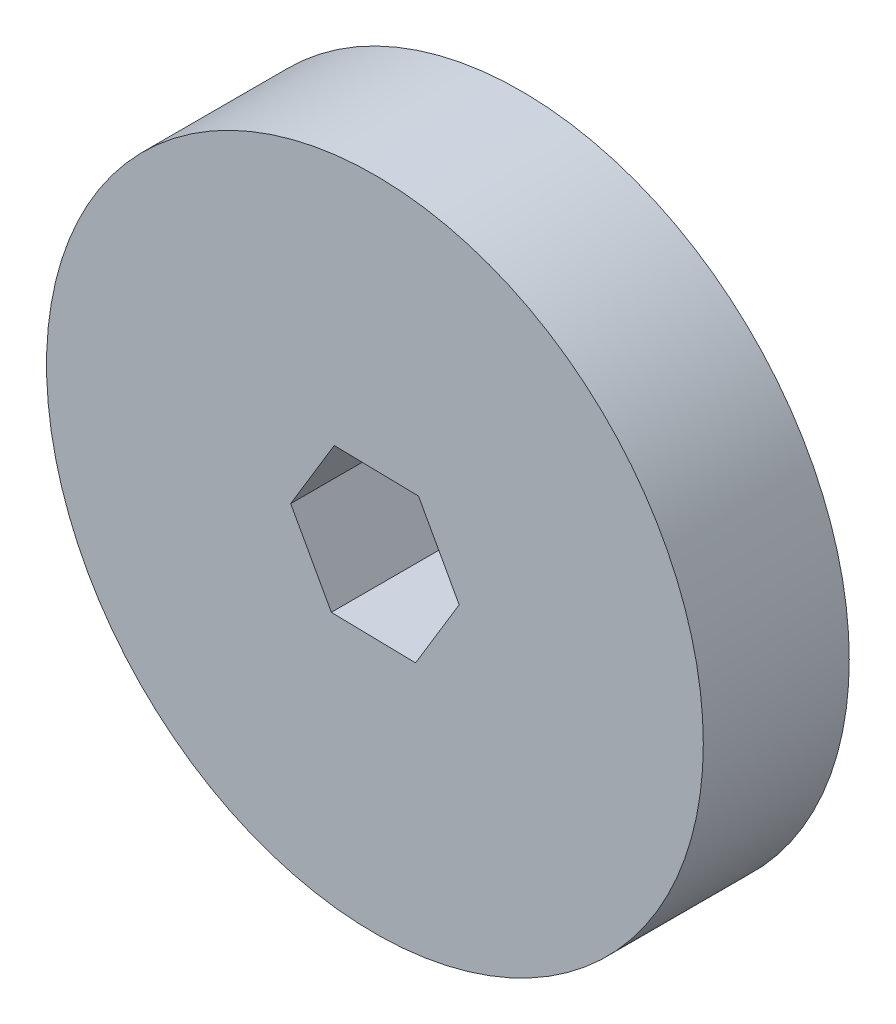
ISO-10303-21;
HEADER;
FILE_DESCRIPTION(('STEP AP214'),'2;1');
FILE_NAME('part.step','',(''),(''),'','','');
FILE_SCHEMA(('AUTOMOTIVE_DESIGN { 1 0 10303 214 1 1 1 1 }'));
ENDSEC;
DATA;
#1=APPLICATION_CONTEXT('core data for automotive mechanical design processes');
#2=APPLICATION_PROTOCOL_DEFINITION('international standard','automotive_design',2000,#1);
#3=PRODUCT_CONTEXT('',#1,'mechanical');
#4=PRODUCT('Part','Part','',(#3));
#5=PRODUCT_RELATED_PRODUCT_CATEGORY('part','',(#4));
#6=PRODUCT_DEFINITION_FORMATION('','',#4);
#7=PRODUCT_DEFINITION_CONTEXT('part definition',#1,'design');
#8=PRODUCT_DEFINITION('design','',#6,#7);
#9=PRODUCT_DEFINITION_SHAPE('','',#8);
#10=(LENGTH_UNIT() NAMED_UNIT(*) SI_UNIT(.MILLI.,.METRE.));
#11=(NAMED_UNIT(*) PLANE_ANGLE_UNIT() SI_UNIT($,.RADIAN.));
#12=(NAMED_UNIT(*) SI_UNIT($,.STERADIAN.) SOLID_ANGLE_UNIT());
#13=UNCERTAINTY_MEASURE_WITH_UNIT(LENGTH_MEASURE(1.E-05),#10,'distance_accuracy_value','');
#14=(GEOMETRIC_REPRESENTATION_CONTEXT(3) GLOBAL_UNCERTAINTY_ASSIGNED_CONTEXT((#13)) GLOBAL_UNIT_ASSIGNED_CONTEXT((#10,
#11,#12)) REPRESENTATION_CONTEXT('',''));
#15=CARTESIAN_POINT('',(0.,0.,0.));
#16=DIRECTION('',(0.,0.,1.));
#17=DIRECTION('',(1.,0.,0.));
#18=AXIS2_PLACEMENT_3D('',#15,#16,#17);
#19=CARTESIAN_POINT('',(0.,0.,12.7));
#20=DIRECTION('',(0.,0.,1.));
#21=DIRECTION('',(1.,0.,0.));
#22=AXIS2_PLACEMENT_3D('',#19,#20,#21);
#23=PLANE('',#22);
#24=CARTESIAN_POINT('',(0.,0.,12.7));
#25=DIRECTION('',(0.,0.,1.));
#26=DIRECTION('',(1.,0.,0.));
#27=AXIS2_PLACEMENT_3D('',#24,#25,#26);
#28=CIRCLE('',#27,28.575);
#29=CARTESIAN_POINT('',(28.575,0.,12.7));
#30=VERTEX_POINT('',#29);
#31=EDGE_CURVE('E11',#30,#30,#28,.T.);
#32=ORIENTED_EDGE('',*,*,#31,.T.);
#33=EDGE_LOOP('',(#32));
#34=FACE_BOUND('',#33,.T.);
#35=DIRECTION('',(0.517256824860244,0.855830226818087,0.));
#36=VECTOR('',#35,1.);
#37=CARTESIAN_POINT('',(3.53816830937983,-6.42220354300871,12.7));
#38=LINE('',#37,#36);
#39=CARTESIAN_POINT('',(3.53816830937983,-6.42220354300871,12.7));
#40=VERTEX_POINT('',#39);
#41=CARTESIAN_POINT('',(7.33087557120989,-0.14695813271639,12.7));
#42=VERTEX_POINT('',#41);
#43=EDGE_CURVE('E94',#40,#42,#38,.T.);
#44=ORIENTED_EDGE('',*,*,#43,.F.);
#45=DIRECTION('',(0.999799130181184,-0.020042437200806,0.));
#46=VECTOR('',#45,1.);
#47=CARTESIAN_POINT('',(-3.79270726183006,-6.27524541029233,12.7));
#48=LINE('',#47,#46);
#49=CARTESIAN_POINT('',(-3.79270726183006,-6.27524541029233,12.7));
#50=VERTEX_POINT('',#49);
#51=EDGE_CURVE('E86',#50,#40,#48,.T.);
#52=ORIENTED_EDGE('',*,*,#51,.F.);
#53=DIRECTION('',(0.48254230532094,-0.875872664018893,0.));
#54=VECTOR('',#53,1.);
#55=CARTESIAN_POINT('',(-7.33087557120989,0.146958132716389,12.7));
#56=LINE('',#55,#54);
#57=CARTESIAN_POINT('',(-7.33087557120989,0.14695813271639,12.7));
#58=VERTEX_POINT('',#57);
#59=EDGE_CURVE('E114',#58,#50,#56,.T.);
#60=ORIENTED_EDGE('',*,*,#59,.F.);
#61=DIRECTION('',(-0.517256824860244,-0.855830226818087,0.));
#62=VECTOR('',#61,1.);
#63=CARTESIAN_POINT('',(-3.53816830937983,6.42220354300871,12.7));
#64=LINE('',#63,#62);
#65=CARTESIAN_POINT('',(-3.53816830937983,6.42220354300871,12.7));
#66=VERTEX_POINT('',#65);
#67=EDGE_CURVE('E112',#66,#58,#64,.T.);
#68=ORIENTED_EDGE('',*,*,#67,.F.);
#69=DIRECTION('',(-0.999799130181184,0.0200424372008056,0.));
#70=VECTOR('',#69,1.);
#71=CARTESIAN_POINT('',(3.79270726183006,6.27524541029232,12.7));
#72=LINE('',#71,#70);
#73=CARTESIAN_POINT('',(3.79270726183006,6.27524541029232,12.7));
#74=VERTEX_POINT('',#73);
#75=EDGE_CURVE('E108',#74,#66,#72,.T.);
#76=ORIENTED_EDGE('',*,*,#75,.F.);
#77=DIRECTION('',(-0.48254230532094,0.875872664018893,0.));
#78=VECTOR('',#77,1.);
#79=CARTESIAN_POINT('',(7.33087557120989,-0.14695813271639,12.7));
#80=LINE('',#79,#78);
#81=EDGE_CURVE('E106',#42,#74,#80,.T.);
#82=ORIENTED_EDGE('',*,*,#81,.F.);
#83=EDGE_LOOP('',(#44,#52,#60,#68,#76,#82));
#84=FACE_BOUND('',#83,.T.);
#85=ADVANCED_FACE('F33',(#34,#84),#23,.T.);
#86=CARTESIAN_POINT('',(0.,0.,0.));
#87=DIRECTION('',(0.,0.,1.));
#88=DIRECTION('',(1.,0.,0.));
#89=AXIS2_PLACEMENT_3D('',#86,#87,#88);
#90=PLANE('',#89);
#91=CARTESIAN_POINT('',(0.,0.,0.));
#92=DIRECTION('',(0.,0.,1.));
#93=DIRECTION('',(1.,0.,0.));
#94=AXIS2_PLACEMENT_3D('',#91,#92,#93);
#95=CIRCLE('',#94,28.575);
#96=CARTESIAN_POINT('',(28.575,0.,0.));
#97=VERTEX_POINT('',#96);
#98=EDGE_CURVE('E37',#97,#97,#95,.T.);
#99=ORIENTED_EDGE('',*,*,#98,.F.);
#100=EDGE_LOOP('',(#99));
#101=FACE_BOUND('',#100,.T.);
#102=DIRECTION('',(0.999799130181184,-0.020042437200806,0.));
#103=VECTOR('',#102,1.);
#104=CARTESIAN_POINT('',(-3.79270726183006,-6.27524541029233,0.));
#105=LINE('',#104,#103);
#106=CARTESIAN_POINT('',(-3.79270726183006,-6.27524541029233,0.));
#107=VERTEX_POINT('',#106);
#108=CARTESIAN_POINT('',(3.53816830937983,-6.42220354300871,0.));
#109=VERTEX_POINT('',#108);
#110=EDGE_CURVE('E56',#107,#109,#105,.T.);
#111=ORIENTED_EDGE('',*,*,#110,.T.);
#112=DIRECTION('',(0.517256824860244,0.855830226818087,0.));
#113=VECTOR('',#112,1.);
#114=CARTESIAN_POINT('',(3.53816830937983,-6.42220354300871,0.));
#115=LINE('',#114,#113);
#116=CARTESIAN_POINT('',(7.33087557120989,-0.14695813271639,0.));
#117=VERTEX_POINT('',#116);
#118=EDGE_CURVE('E101',#109,#117,#115,.T.);
#119=ORIENTED_EDGE('',*,*,#118,.T.);
#120=DIRECTION('',(-0.48254230532094,0.875872664018893,0.));
#121=VECTOR('',#120,1.);
#122=CARTESIAN_POINT('',(7.33087557120989,-0.14695813271639,0.));
#123=LINE('',#122,#121);
#124=CARTESIAN_POINT('',(3.79270726183006,6.27524541029232,0.));
#125=VERTEX_POINT('',#124);
#126=EDGE_CURVE('E118',#117,#125,#123,.T.);
#127=ORIENTED_EDGE('',*,*,#126,.T.);
#128=DIRECTION('',(-0.999799130181184,0.0200424372008056,0.));
#129=VECTOR('',#128,1.);
#130=CARTESIAN_POINT('',(3.79270726183006,6.27524541029232,0.));
#131=LINE('',#130,#129);
#132=CARTESIAN_POINT('',(-3.53816830937983,6.42220354300871,0.));
#133=VERTEX_POINT('',#132);
#134=EDGE_CURVE('E121',#125,#133,#131,.T.);
#135=ORIENTED_EDGE('',*,*,#134,.T.);
#136=DIRECTION('',(-0.517256824860244,-0.855830226818087,0.));
#137=VECTOR('',#136,1.);
#138=CARTESIAN_POINT('',(-3.53816830937983,6.42220354300871,0.));
#139=LINE('',#138,#137);
#140=CARTESIAN_POINT('',(-7.33087557120989,0.146958132716389,0.));
#141=VERTEX_POINT('',#140);
#142=EDGE_CURVE('E124',#133,#141,#139,.T.);
#143=ORIENTED_EDGE('',*,*,#142,.T.);
#144=DIRECTION('',(0.48254230532094,-0.875872664018893,0.));
#145=VECTOR('',#144,1.);
#146=CARTESIAN_POINT('',(-7.33087557120989,0.146958132716389,0.));
#147=LINE('',#146,#145);
#148=EDGE_CURVE('E95',#141,#107,#147,.T.);
#149=ORIENTED_EDGE('',*,*,#148,.T.);
#150=EDGE_LOOP('',(#111,#119,#127,#135,#143,#149));
#151=FACE_BOUND('',#150,.T.);
#152=ADVANCED_FACE('F141',(#101,#151),#90,.F.);
#153=CARTESIAN_POINT('',(0.,0.,12.7));
#154=DIRECTION('',(0.,0.,-1.));
#155=DIRECTION('',(-1.,0.,0.));
#156=AXIS2_PLACEMENT_3D('',#153,#154,#155);
#157=CYLINDRICAL_SURFACE('',#156,28.575);
#158=ORIENTED_EDGE('',*,*,#31,.F.);
#159=EDGE_LOOP('',(#158));
#160=FACE_BOUND('',#159,.T.);
#161=ORIENTED_EDGE('',*,*,#98,.T.);
#162=EDGE_LOOP('',(#161));
#163=FACE_BOUND('',#162,.T.);
#164=ADVANCED_FACE('F35',(#160,#163),#157,.T.);
#165=CARTESIAN_POINT('',(-3.79270726183006,-6.27524541029233,12.7));
#166=DIRECTION('',(0.020042437200806,0.999799130181184,0.));
#167=DIRECTION('',(-0.999799130181184,0.020042437200806,0.));
#168=AXIS2_PLACEMENT_3D('',#165,#166,#167);
#169=PLANE('',#168);
#170=ORIENTED_EDGE('',*,*,#110,.F.);
#171=DIRECTION('',(0.,0.,-1.));
#172=VECTOR('',#171,1.);
#173=CARTESIAN_POINT('',(-3.79270726183006,-6.27524541029233,12.7));
#174=LINE('',#173,#172);
#175=EDGE_CURVE('E90',#50,#107,#174,.T.);
#176=ORIENTED_EDGE('',*,*,#175,.F.);
#177=ORIENTED_EDGE('',*,*,#51,.T.);
#178=DIRECTION('',(0.,0.,-1.));
#179=VECTOR('',#178,1.);
#180=CARTESIAN_POINT('',(3.53816830937983,-6.42220354300871,12.7));
#181=LINE('',#180,#179);
#182=EDGE_CURVE('E89',#40,#109,#181,.T.);
#183=ORIENTED_EDGE('',*,*,#182,.T.);
#184=EDGE_LOOP('',(#170,#176,#177,#183));
#185=FACE_BOUND('',#184,.T.);
#186=ADVANCED_FACE('F88',(#185),#169,.T.);
#187=CARTESIAN_POINT('',(3.53816830937983,-6.42220354300871,12.7));
#188=DIRECTION('',(-0.855830226818087,0.517256824860244,0.));
#189=DIRECTION('',(-0.517256824860244,-0.855830226818087,0.));
#190=AXIS2_PLACEMENT_3D('',#187,#188,#189);
#191=PLANE('',#190);
#192=ORIENTED_EDGE('',*,*,#118,.F.);
#193=ORIENTED_EDGE('',*,*,#182,.F.);
#194=ORIENTED_EDGE('',*,*,#43,.T.);
#195=DIRECTION('',(0.,0.,-1.));
#196=VECTOR('',#195,1.);
#197=CARTESIAN_POINT('',(7.33087557120989,-0.14695813271639,12.7));
#198=LINE('',#197,#196);
#199=EDGE_CURVE('E102',#42,#117,#198,.T.);
#200=ORIENTED_EDGE('',*,*,#199,.T.);
#201=EDGE_LOOP('',(#192,#193,#194,#200));
#202=FACE_BOUND('',#201,.T.);
#203=ADVANCED_FACE('F98',(#202),#191,.T.);
#204=CARTESIAN_POINT('',(7.33087557120989,-0.14695813271639,12.7));
#205=DIRECTION('',(-0.875872664018893,-0.48254230532094,0.));
#206=DIRECTION('',(0.48254230532094,-0.875872664018893,0.));
#207=AXIS2_PLACEMENT_3D('',#204,#205,#206);
#208=PLANE('',#207);
#209=ORIENTED_EDGE('',*,*,#126,.F.);
#210=ORIENTED_EDGE('',*,*,#199,.F.);
#211=ORIENTED_EDGE('',*,*,#81,.T.);
#212=DIRECTION('',(0.,0.,-1.));
#213=VECTOR('',#212,1.);
#214=CARTESIAN_POINT('',(3.79270726183006,6.27524541029232,12.7));
#215=LINE('',#214,#213);
#216=EDGE_CURVE('E133',#74,#125,#215,.T.);
#217=ORIENTED_EDGE('',*,*,#216,.T.);
#218=EDGE_LOOP('',(#209,#210,#211,#217));
#219=FACE_BOUND('',#218,.T.);
#220=ADVANCED_FACE('F137',(#219),#208,.T.);
#221=CARTESIAN_POINT('',(3.79270726183006,6.27524541029232,12.7));
#222=DIRECTION('',(-0.0200424372008056,-0.999799130181184,0.));
#223=DIRECTION('',(0.999799130181184,-0.0200424372008056,0.));
#224=AXIS2_PLACEMENT_3D('',#221,#222,#223);
#225=PLANE('',#224);
#226=ORIENTED_EDGE('',*,*,#134,.F.);
#227=ORIENTED_EDGE('',*,*,#216,.F.);
#228=ORIENTED_EDGE('',*,*,#75,.T.);
#229=DIRECTION('',(0.,0.,-1.));
#230=VECTOR('',#229,1.);
#231=CARTESIAN_POINT('',(-3.53816830937983,6.42220354300871,12.7));
#232=LINE('',#231,#230);
#233=EDGE_CURVE('E131',#66,#133,#232,.T.);
#234=ORIENTED_EDGE('',*,*,#233,.T.);
#235=EDGE_LOOP('',(#226,#227,#228,#234));
#236=FACE_BOUND('',#235,.T.);
#237=ADVANCED_FACE('F149',(#236),#225,.T.);
#238=CARTESIAN_POINT('',(-3.53816830937983,6.42220354300871,12.7));
#239=DIRECTION('',(0.855830226818087,-0.517256824860244,0.));
#240=DIRECTION('',(0.517256824860244,0.855830226818088,0.));
#241=AXIS2_PLACEMENT_3D('',#238,#239,#240);
#242=PLANE('',#241);
#243=ORIENTED_EDGE('',*,*,#142,.F.);
#244=ORIENTED_EDGE('',*,*,#233,.F.);
#245=ORIENTED_EDGE('',*,*,#67,.T.);
#246=DIRECTION('',(0.,0.,-1.));
#247=VECTOR('',#246,1.);
#248=CARTESIAN_POINT('',(-7.33087557120989,0.146958132716389,12.7));
#249=LINE('',#248,#247);
#250=EDGE_CURVE('E48',#58,#141,#249,.T.);
#251=ORIENTED_EDGE('',*,*,#250,.T.);
#252=EDGE_LOOP('',(#243,#244,#245,#251));
#253=FACE_BOUND('',#252,.T.);
#254=ADVANCED_FACE('F147',(#253),#242,.T.);
#255=CARTESIAN_POINT('',(-7.33087557120989,0.146958132716389,12.7));
#256=DIRECTION('',(0.875872664018893,0.48254230532094,0.));
#257=DIRECTION('',(-0.48254230532094,0.875872664018893,0.));
#258=AXIS2_PLACEMENT_3D('',#255,#256,#257);
#259=PLANE('',#258);
#260=ORIENTED_EDGE('',*,*,#148,.F.);
#261=ORIENTED_EDGE('',*,*,#250,.F.);
#262=ORIENTED_EDGE('',*,*,#59,.T.);
#263=ORIENTED_EDGE('',*,*,#175,.T.);
#264=EDGE_LOOP('',(#260,#261,#262,#263));
#265=FACE_BOUND('',#264,.T.);
#266=ADVANCED_FACE('F143',(#265),#259,.T.);
#267=CLOSED_SHELL('',(#85,#152,#164,#186,#203,#220,#237,#254,#266));
#268=MANIFOLD_SOLID_BREP('B2',#267);
#269=ADVANCED_BREP_SHAPE_REPRESENTATION('',(#18,#268),#14);
#270=SHAPE_DEFINITION_REPRESENTATION(#9,#269);
ENDSEC;
END-ISO-10303-21;
